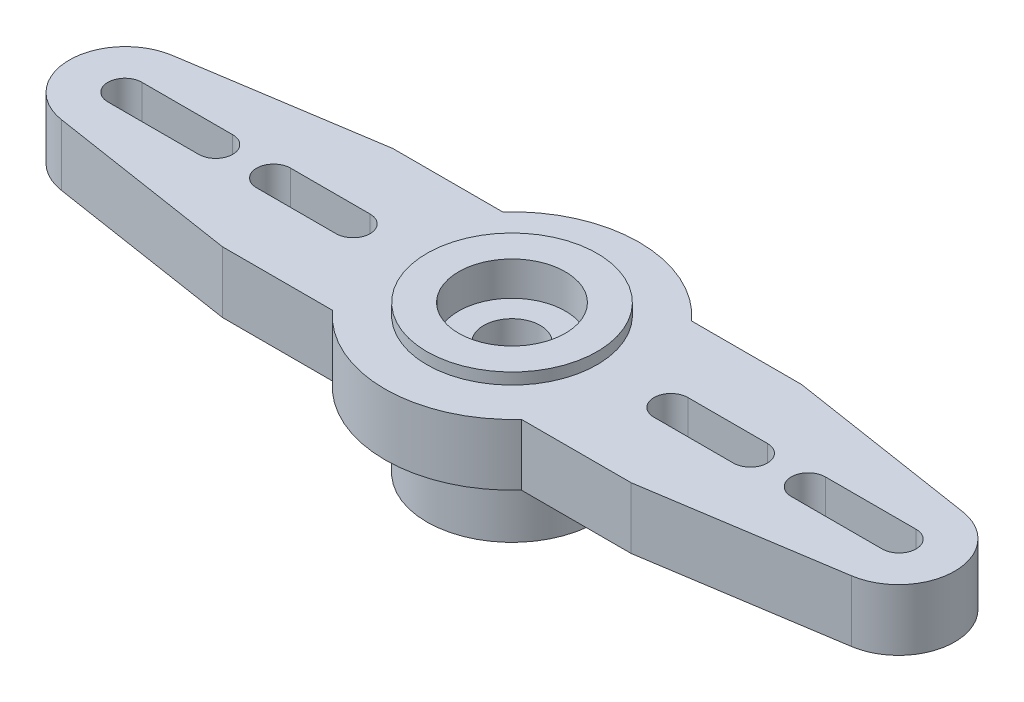
ISO-10303-21;
HEADER;
FILE_DESCRIPTION(('STEP AP214'),'2;1');
FILE_NAME('part.step','',(''),(''),'','','');
FILE_SCHEMA(('AUTOMOTIVE_DESIGN { 1 0 10303 214 1 1 1 1 }'));
ENDSEC;
DATA;
#1=APPLICATION_CONTEXT('core data for automotive mechanical design processes');
#2=APPLICATION_PROTOCOL_DEFINITION('international standard','automotive_design',2000,#1);
#3=PRODUCT_CONTEXT('',#1,'mechanical');
#4=PRODUCT('Part','Part','',(#3));
#5=PRODUCT_RELATED_PRODUCT_CATEGORY('part','',(#4));
#6=PRODUCT_DEFINITION_FORMATION('','',#4);
#7=PRODUCT_DEFINITION_CONTEXT('part definition',#1,'design');
#8=PRODUCT_DEFINITION('design','',#6,#7);
#9=PRODUCT_DEFINITION_SHAPE('','',#8);
#10=(LENGTH_UNIT() NAMED_UNIT(*) SI_UNIT(.MILLI.,.METRE.));
#11=(NAMED_UNIT(*) PLANE_ANGLE_UNIT() SI_UNIT($,.RADIAN.));
#12=(NAMED_UNIT(*) SI_UNIT($,.STERADIAN.) SOLID_ANGLE_UNIT());
#13=UNCERTAINTY_MEASURE_WITH_UNIT(LENGTH_MEASURE(1.E-05),#10,'distance_accuracy_value','');
#14=(GEOMETRIC_REPRESENTATION_CONTEXT(3) GLOBAL_UNCERTAINTY_ASSIGNED_CONTEXT((#13)) GLOBAL_UNIT_ASSIGNED_CONTEXT((#10,
#11,#12)) REPRESENTATION_CONTEXT('',''));
#15=CARTESIAN_POINT('',(0.,0.,0.));
#16=DIRECTION('',(0.,0.,1.));
#17=DIRECTION('',(1.,0.,0.));
#18=AXIS2_PLACEMENT_3D('',#15,#16,#17);
#19=CARTESIAN_POINT('',(0.,6.5,0.));
#20=DIRECTION('',(0.,-1.,0.));
#21=DIRECTION('',(0.,0.,-1.));
#22=AXIS2_PLACEMENT_3D('',#19,#20,#21);
#23=CYLINDRICAL_SURFACE('',#22,3.75);
#24=CARTESIAN_POINT('',(0.,0.,0.));
#25=DIRECTION('',(0.,1.,0.));
#26=DIRECTION('',(0.,0.,1.));
#27=AXIS2_PLACEMENT_3D('',#24,#25,#26);
#28=CIRCLE('',#27,3.75);
#29=CARTESIAN_POINT('',(0.,0.,3.75));
#30=VERTEX_POINT('',#29);
#31=EDGE_CURVE('E331',#30,#30,#28,.T.);
#32=ORIENTED_EDGE('',*,*,#31,.T.);
#33=EDGE_LOOP('',(#32));
#34=FACE_BOUND('',#33,.T.);
#35=CARTESIAN_POINT('',(0.,3.3,0.));
#36=DIRECTION('',(0.,1.,0.));
#37=DIRECTION('',(0.,0.,1.));
#38=AXIS2_PLACEMENT_3D('',#35,#36,#37);
#39=CIRCLE('',#38,3.75);
#40=CARTESIAN_POINT('',(0.,3.3,3.75));
#41=VERTEX_POINT('',#40);
#42=EDGE_CURVE('E12',#41,#41,#39,.T.);
#43=ORIENTED_EDGE('',*,*,#42,.F.);
#44=EDGE_LOOP('',(#43));
#45=FACE_BOUND('',#44,.T.);
#46=ADVANCED_FACE('F91',(#34,#45),#23,.T.);
#47=CARTESIAN_POINT('',(0.,0.,0.));
#48=DIRECTION('',(0.,1.,0.));
#49=DIRECTION('',(0.,0.,1.));
#50=AXIS2_PLACEMENT_3D('',#47,#48,#49);
#51=CYLINDRICAL_SURFACE('',#50,1.25);
#52=CARTESIAN_POINT('',(0.,5.,0.));
#53=DIRECTION('',(0.,1.,0.));
#54=DIRECTION('',(0.,0.,1.));
#55=AXIS2_PLACEMENT_3D('',#52,#53,#54);
#56=CIRCLE('',#55,1.25);
#57=CARTESIAN_POINT('',(0.,5.,1.25));
#58=VERTEX_POINT('',#57);
#59=EDGE_CURVE('E328',#58,#58,#56,.F.);
#60=ORIENTED_EDGE('',*,*,#59,.F.);
#61=EDGE_LOOP('',(#60));
#62=FACE_BOUND('',#61,.T.);
#63=CARTESIAN_POINT('',(0.,3.4,0.));
#64=DIRECTION('',(0.,-1.,0.));
#65=DIRECTION('',(0.,0.,-1.));
#66=AXIS2_PLACEMENT_3D('',#63,#64,#65);
#67=CIRCLE('',#66,1.25);
#68=CARTESIAN_POINT('',(0.,3.4,-1.25));
#69=VERTEX_POINT('',#68);
#70=EDGE_CURVE('E321',#69,#69,#67,.F.);
#71=ORIENTED_EDGE('',*,*,#70,.F.);
#72=EDGE_LOOP('',(#71));
#73=FACE_BOUND('',#72,.T.);
#74=ADVANCED_FACE('F343',(#62,#73),#51,.F.);
#75=CARTESIAN_POINT('',(0.,6.,0.));
#76=DIRECTION('',(0.,1.,0.));
#77=DIRECTION('',(0.,0.,1.));
#78=AXIS2_PLACEMENT_3D('',#75,#76,#77);
#79=CIRCLE('',#78,3.75);
#80=CARTESIAN_POINT('',(0.,6.,3.75));
#81=VERTEX_POINT('',#80);
#82=EDGE_CURVE('E306',#81,#81,#79,.T.);
#83=ORIENTED_EDGE('',*,*,#82,.T.);
#84=EDGE_LOOP('',(#83));
#85=FACE_BOUND('',#84,.T.);
#86=CARTESIAN_POINT('',(0.,6.5,0.));
#87=DIRECTION('',(0.,1.,0.));
#88=DIRECTION('',(0.,0.,1.));
#89=AXIS2_PLACEMENT_3D('',#86,#87,#88);
#90=CIRCLE('',#89,3.75);
#91=CARTESIAN_POINT('',(0.,6.5,3.75));
#92=VERTEX_POINT('',#91);
#93=EDGE_CURVE('E100',#92,#92,#90,.T.);
#94=ORIENTED_EDGE('',*,*,#93,.F.);
#95=EDGE_LOOP('',(#94));
#96=FACE_BOUND('',#95,.T.);
#97=ADVANCED_FACE('F93',(#85,#96),#23,.T.);
#98=CARTESIAN_POINT('',(0.,6.5,0.));
#99=DIRECTION('',(0.,1.,0.));
#100=DIRECTION('',(0.,0.,1.));
#101=AXIS2_PLACEMENT_3D('',#98,#99,#100);
#102=PLANE('',#101);
#103=CARTESIAN_POINT('',(0.,6.5,0.));
#104=DIRECTION('',(0.,1.,0.));
#105=DIRECTION('',(0.,0.,1.));
#106=AXIS2_PLACEMENT_3D('',#103,#104,#105);
#107=CIRCLE('',#106,2.35);
#108=CARTESIAN_POINT('',(0.,6.5,2.35));
#109=VERTEX_POINT('',#108);
#110=EDGE_CURVE('E334',#109,#109,#107,.F.);
#111=ORIENTED_EDGE('',*,*,#110,.T.);
#112=EDGE_LOOP('',(#111));
#113=FACE_BOUND('',#112,.T.);
#114=ORIENTED_EDGE('',*,*,#93,.T.);
#115=EDGE_LOOP('',(#114));
#116=FACE_BOUND('',#115,.T.);
#117=ADVANCED_FACE('F352',(#113,#116),#102,.T.);
#118=CARTESIAN_POINT('',(0.,0.,0.));
#119=DIRECTION('',(0.,1.,0.));
#120=DIRECTION('',(0.,0.,1.));
#121=AXIS2_PLACEMENT_3D('',#118,#119,#120);
#122=PLANE('',#121);
#123=CARTESIAN_POINT('',(0.,0.,0.));
#124=DIRECTION('',(0.,-1.,0.));
#125=DIRECTION('',(0.,0.,-1.));
#126=AXIS2_PLACEMENT_3D('',#123,#124,#125);
#127=CIRCLE('',#126,2.35);
#128=CARTESIAN_POINT('',(0.,0.,-2.35));
#129=VERTEX_POINT('',#128);
#130=EDGE_CURVE('E322',#129,#129,#127,.T.);
#131=ORIENTED_EDGE('',*,*,#130,.F.);
#132=EDGE_LOOP('',(#131));
#133=FACE_BOUND('',#132,.T.);
#134=ORIENTED_EDGE('',*,*,#31,.F.);
#135=EDGE_LOOP('',(#134));
#136=FACE_BOUND('',#135,.T.);
#137=ADVANCED_FACE('F362',(#133,#136),#122,.F.);
#138=CARTESIAN_POINT('',(0.,5.,0.));
#139=DIRECTION('',(0.,1.,0.));
#140=DIRECTION('',(0.,0.,1.));
#141=AXIS2_PLACEMENT_3D('',#138,#139,#140);
#142=PLANE('',#141);
#143=CARTESIAN_POINT('',(0.,5.,0.));
#144=DIRECTION('',(0.,1.,0.));
#145=DIRECTION('',(0.,0.,1.));
#146=AXIS2_PLACEMENT_3D('',#143,#144,#145);
#147=CIRCLE('',#146,2.35);
#148=CARTESIAN_POINT('',(0.,5.,2.35));
#149=VERTEX_POINT('',#148);
#150=EDGE_CURVE('E325',#149,#149,#147,.T.);
#151=ORIENTED_EDGE('',*,*,#150,.T.);
#152=EDGE_LOOP('',(#151));
#153=FACE_BOUND('',#152,.T.);
#154=ORIENTED_EDGE('',*,*,#59,.T.);
#155=EDGE_LOOP('',(#154));
#156=FACE_BOUND('',#155,.T.);
#157=ADVANCED_FACE('F364',(#153,#156),#142,.T.);
#158=CARTESIAN_POINT('',(0.,6.500012,0.));
#159=DIRECTION('',(0.,-1.,0.));
#160=DIRECTION('',(0.,0.,-1.));
#161=AXIS2_PLACEMENT_3D('',#158,#159,#160);
#162=CYLINDRICAL_SURFACE('',#161,2.35);
#163=ORIENTED_EDGE('',*,*,#110,.F.);
#164=EDGE_LOOP('',(#163));
#165=FACE_BOUND('',#164,.T.);
#166=ORIENTED_EDGE('',*,*,#150,.F.);
#167=EDGE_LOOP('',(#166));
#168=FACE_BOUND('',#167,.T.);
#169=ADVANCED_FACE('F359',(#165,#168),#162,.F.);
#170=CARTESIAN_POINT('',(0.,3.4,0.));
#171=DIRECTION('',(0.,-1.,0.));
#172=DIRECTION('',(0.,0.,-1.));
#173=AXIS2_PLACEMENT_3D('',#170,#171,#172);
#174=PLANE('',#173);
#175=CARTESIAN_POINT('',(0.,3.4,0.));
#176=DIRECTION('',(0.,-1.,0.));
#177=DIRECTION('',(0.,0.,-1.));
#178=AXIS2_PLACEMENT_3D('',#175,#176,#177);
#179=CIRCLE('',#178,2.35);
#180=CARTESIAN_POINT('',(0.,3.4,-2.35));
#181=VERTEX_POINT('',#180);
#182=EDGE_CURVE('E318',#181,#181,#179,.T.);
#183=ORIENTED_EDGE('',*,*,#182,.T.);
#184=EDGE_LOOP('',(#183));
#185=FACE_BOUND('',#184,.T.);
#186=ORIENTED_EDGE('',*,*,#70,.T.);
#187=EDGE_LOOP('',(#186));
#188=FACE_BOUND('',#187,.T.);
#189=ADVANCED_FACE('F341',(#185,#188),#174,.T.);
#190=CARTESIAN_POINT('',(0.,3.4,0.));
#191=DIRECTION('',(0.,-1.,0.));
#192=DIRECTION('',(0.,0.,-1.));
#193=AXIS2_PLACEMENT_3D('',#190,#191,#192);
#194=CYLINDRICAL_SURFACE('',#193,2.35);
#195=ORIENTED_EDGE('',*,*,#182,.F.);
#196=EDGE_LOOP('',(#195));
#197=FACE_BOUND('',#196,.T.);
#198=ORIENTED_EDGE('',*,*,#130,.T.);
#199=EDGE_LOOP('',(#198));
#200=FACE_BOUND('',#199,.T.);
#201=ADVANCED_FACE('F674',(#197,#200),#194,.F.);
#202=CARTESIAN_POINT('',(0.,3.3,0.75));
#203=DIRECTION('',(0.,0.,-1.));
#204=DIRECTION('',(-1.,0.,0.));
#205=AXIS2_PLACEMENT_3D('',#202,#203,#204);
#206=PLANE('',#205);
#207=DIRECTION('',(-1.,0.,0.));
#208=VECTOR('',#207,1.);
#209=CARTESIAN_POINT('',(0.,6.,0.75));
#210=LINE('',#209,#208);
#211=CARTESIAN_POINT('',(-7.,6.,0.75));
#212=VERTEX_POINT('',#211);
#213=CARTESIAN_POINT('',(-10.5,6.,0.75));
#214=VERTEX_POINT('',#213);
#215=EDGE_CURVE('E529',#212,#214,#210,.T.);
#216=ORIENTED_EDGE('',*,*,#215,.F.);
#217=DIRECTION('',(0.,1.,0.));
#218=VECTOR('',#217,1.);
#219=CARTESIAN_POINT('',(-7.,3.3,0.75));
#220=LINE('',#219,#218);
#221=CARTESIAN_POINT('',(-7.,3.3,0.75));
#222=VERTEX_POINT('',#221);
#223=EDGE_CURVE('E108',#222,#212,#220,.T.);
#224=ORIENTED_EDGE('',*,*,#223,.F.);
#225=DIRECTION('',(-1.,0.,0.));
#226=VECTOR('',#225,1.);
#227=CARTESIAN_POINT('',(0.,3.3,0.75));
#228=LINE('',#227,#226);
#229=CARTESIAN_POINT('',(-10.5,3.3,0.75));
#230=VERTEX_POINT('',#229);
#231=EDGE_CURVE('E565',#222,#230,#228,.T.);
#232=ORIENTED_EDGE('',*,*,#231,.T.);
#233=DIRECTION('',(0.,1.,0.));
#234=VECTOR('',#233,1.);
#235=CARTESIAN_POINT('',(-10.5,3.3,0.75));
#236=LINE('',#235,#234);
#237=EDGE_CURVE('E512',#230,#214,#236,.T.);
#238=ORIENTED_EDGE('',*,*,#237,.T.);
#239=EDGE_LOOP('',(#216,#224,#232,#238));
#240=FACE_BOUND('',#239,.T.);
#241=ADVANCED_FACE('F435',(#240),#206,.T.);
#242=CARTESIAN_POINT('',(-7.,3.3,0.));
#243=DIRECTION('',(0.,1.,0.));
#244=DIRECTION('',(0.,0.,1.));
#245=AXIS2_PLACEMENT_3D('',#242,#243,#244);
#246=CYLINDRICAL_SURFACE('',#245,0.75);
#247=CARTESIAN_POINT('',(-7.,6.,0.));
#248=DIRECTION('',(0.,1.,0.));
#249=DIRECTION('',(0.,0.,1.));
#250=AXIS2_PLACEMENT_3D('',#247,#248,#249);
#251=CIRCLE('',#250,0.75);
#252=CARTESIAN_POINT('',(-7.,6.,-0.75));
#253=VERTEX_POINT('',#252);
#254=EDGE_CURVE('E519',#253,#212,#251,.F.);
#255=ORIENTED_EDGE('',*,*,#254,.F.);
#256=DIRECTION('',(0.,1.,0.));
#257=VECTOR('',#256,1.);
#258=CARTESIAN_POINT('',(-7.,3.3,-0.75));
#259=LINE('',#258,#257);
#260=CARTESIAN_POINT('',(-7.,3.3,-0.75));
#261=VERTEX_POINT('',#260);
#262=EDGE_CURVE('E516',#261,#253,#259,.T.);
#263=ORIENTED_EDGE('',*,*,#262,.F.);
#264=CARTESIAN_POINT('',(-7.,3.3,0.));
#265=DIRECTION('',(0.,1.,0.));
#266=DIRECTION('',(0.,0.,1.));
#267=AXIS2_PLACEMENT_3D('',#264,#265,#266);
#268=CIRCLE('',#267,0.75);
#269=EDGE_CURVE('E494',#261,#222,#268,.F.);
#270=ORIENTED_EDGE('',*,*,#269,.T.);
#271=ORIENTED_EDGE('',*,*,#223,.T.);
#272=EDGE_LOOP('',(#255,#263,#270,#271));
#273=FACE_BOUND('',#272,.T.);
#274=ADVANCED_FACE('F650',(#273),#246,.F.);
#275=CARTESIAN_POINT('',(0.,3.3,-0.75));
#276=DIRECTION('',(0.,0.,-1.));
#277=DIRECTION('',(-1.,0.,0.));
#278=AXIS2_PLACEMENT_3D('',#275,#276,#277);
#279=PLANE('',#278);
#280=DIRECTION('',(-1.,0.,0.));
#281=VECTOR('',#280,1.);
#282=CARTESIAN_POINT('',(0.,6.,-0.75));
#283=LINE('',#282,#281);
#284=CARTESIAN_POINT('',(-10.5,6.,-0.75));
#285=VERTEX_POINT('',#284);
#286=EDGE_CURVE('E523',#253,#285,#283,.T.);
#287=ORIENTED_EDGE('',*,*,#286,.T.);
#288=DIRECTION('',(0.,1.,0.));
#289=VECTOR('',#288,1.);
#290=CARTESIAN_POINT('',(-10.5,3.3,-0.75));
#291=LINE('',#290,#289);
#292=CARTESIAN_POINT('',(-10.5,3.3,-0.75));
#293=VERTEX_POINT('',#292);
#294=EDGE_CURVE('E514',#293,#285,#291,.T.);
#295=ORIENTED_EDGE('',*,*,#294,.F.);
#296=DIRECTION('',(-1.,0.,0.));
#297=VECTOR('',#296,1.);
#298=CARTESIAN_POINT('',(0.,3.3,-0.75));
#299=LINE('',#298,#297);
#300=EDGE_CURVE('E559',#261,#293,#299,.T.);
#301=ORIENTED_EDGE('',*,*,#300,.F.);
#302=ORIENTED_EDGE('',*,*,#262,.T.);
#303=EDGE_LOOP('',(#287,#295,#301,#302));
#304=FACE_BOUND('',#303,.T.);
#305=ADVANCED_FACE('F644',(#304),#279,.F.);
#306=CARTESIAN_POINT('',(0.,3.3,0.749999999999998));
#307=DIRECTION('',(0.,0.,-1.));
#308=DIRECTION('',(-1.,0.,0.));
#309=AXIS2_PLACEMENT_3D('',#306,#307,#308);
#310=PLANE('',#309);
#311=DIRECTION('',(-1.,0.,0.));
#312=VECTOR('',#311,1.);
#313=CARTESIAN_POINT('',(0.,6.,0.749999999999998));
#314=LINE('',#313,#312);
#315=CARTESIAN_POINT('',(-13.05,6.,0.749999999999998));
#316=VERTEX_POINT('',#315);
#317=CARTESIAN_POINT('',(-17.05,6.,0.749999999999998));
#318=VERTEX_POINT('',#317);
#319=EDGE_CURVE('E541',#316,#318,#314,.T.);
#320=ORIENTED_EDGE('',*,*,#319,.F.);
#321=DIRECTION('',(0.,1.,0.));
#322=VECTOR('',#321,1.);
#323=CARTESIAN_POINT('',(-13.05,3.3,0.749999999999998));
#324=LINE('',#323,#322);
#325=CARTESIAN_POINT('',(-13.05,3.3,0.749999999999998));
#326=VERTEX_POINT('',#325);
#327=EDGE_CURVE('E510',#326,#316,#324,.T.);
#328=ORIENTED_EDGE('',*,*,#327,.F.);
#329=DIRECTION('',(-1.,0.,0.));
#330=VECTOR('',#329,1.);
#331=CARTESIAN_POINT('',(0.,3.3,0.749999999999998));
#332=LINE('',#331,#330);
#333=CARTESIAN_POINT('',(-17.05,3.3,0.749999999999998));
#334=VERTEX_POINT('',#333);
#335=EDGE_CURVE('E576',#326,#334,#332,.T.);
#336=ORIENTED_EDGE('',*,*,#335,.T.);
#337=DIRECTION('',(0.,1.,0.));
#338=VECTOR('',#337,1.);
#339=CARTESIAN_POINT('',(-17.05,3.3,0.749999999999998));
#340=LINE('',#339,#338);
#341=EDGE_CURVE('E504',#334,#318,#340,.T.);
#342=ORIENTED_EDGE('',*,*,#341,.T.);
#343=EDGE_LOOP('',(#320,#328,#336,#342));
#344=FACE_BOUND('',#343,.T.);
#345=ADVANCED_FACE('F668',(#344),#310,.T.);
#346=CARTESIAN_POINT('',(-13.05,3.3,0.));
#347=DIRECTION('',(0.,1.,0.));
#348=DIRECTION('',(0.,0.,1.));
#349=AXIS2_PLACEMENT_3D('',#346,#347,#348);
#350=CYLINDRICAL_SURFACE('',#349,0.749999999999998);
#351=CARTESIAN_POINT('',(-13.05,6.,0.));
#352=DIRECTION('',(0.,1.,0.));
#353=DIRECTION('',(0.,0.,1.));
#354=AXIS2_PLACEMENT_3D('',#351,#352,#353);
#355=CIRCLE('',#354,0.749999999999998);
#356=CARTESIAN_POINT('',(-13.05,6.,-0.749999999999998));
#357=VERTEX_POINT('',#356);
#358=EDGE_CURVE('E532',#357,#316,#355,.F.);
#359=ORIENTED_EDGE('',*,*,#358,.F.);
#360=DIRECTION('',(0.,1.,0.));
#361=VECTOR('',#360,1.);
#362=CARTESIAN_POINT('',(-13.05,3.3,-0.749999999999998));
#363=LINE('',#362,#361);
#364=CARTESIAN_POINT('',(-13.05,3.3,-0.749999999999998));
#365=VERTEX_POINT('',#364);
#366=EDGE_CURVE('E508',#365,#357,#363,.T.);
#367=ORIENTED_EDGE('',*,*,#366,.F.);
#368=CARTESIAN_POINT('',(-13.05,3.3,0.));
#369=DIRECTION('',(0.,1.,0.));
#370=DIRECTION('',(0.,0.,1.));
#371=AXIS2_PLACEMENT_3D('',#368,#369,#370);
#372=CIRCLE('',#371,0.749999999999998);
#373=EDGE_CURVE('E567',#365,#326,#372,.F.);
#374=ORIENTED_EDGE('',*,*,#373,.T.);
#375=ORIENTED_EDGE('',*,*,#327,.T.);
#376=EDGE_LOOP('',(#359,#367,#374,#375));
#377=FACE_BOUND('',#376,.T.);
#378=ADVANCED_FACE('F675',(#377),#350,.F.);
#379=CARTESIAN_POINT('',(0.,3.3,-0.749999999999998));
#380=DIRECTION('',(0.,0.,-1.));
#381=DIRECTION('',(-1.,0.,0.));
#382=AXIS2_PLACEMENT_3D('',#379,#380,#381);
#383=PLANE('',#382);
#384=DIRECTION('',(-1.,0.,0.));
#385=VECTOR('',#384,1.);
#386=CARTESIAN_POINT('',(0.,6.,-0.749999999999998));
#387=LINE('',#386,#385);
#388=CARTESIAN_POINT('',(-17.05,6.,-0.749999999999998));
#389=VERTEX_POINT('',#388);
#390=EDGE_CURVE('E535',#357,#389,#387,.T.);
#391=ORIENTED_EDGE('',*,*,#390,.T.);
#392=DIRECTION('',(0.,1.,0.));
#393=VECTOR('',#392,1.);
#394=CARTESIAN_POINT('',(-17.05,3.3,-0.749999999999998));
#395=LINE('',#394,#393);
#396=CARTESIAN_POINT('',(-17.05,3.3,-0.749999999999998));
#397=VERTEX_POINT('',#396);
#398=EDGE_CURVE('E506',#397,#389,#395,.T.);
#399=ORIENTED_EDGE('',*,*,#398,.F.);
#400=DIRECTION('',(-1.,0.,0.));
#401=VECTOR('',#400,1.);
#402=CARTESIAN_POINT('',(0.,3.3,-0.749999999999998));
#403=LINE('',#402,#401);
#404=EDGE_CURVE('E570',#365,#397,#403,.T.);
#405=ORIENTED_EDGE('',*,*,#404,.F.);
#406=ORIENTED_EDGE('',*,*,#366,.T.);
#407=EDGE_LOOP('',(#391,#399,#405,#406));
#408=FACE_BOUND('',#407,.T.);
#409=ADVANCED_FACE('F678',(#408),#383,.F.);
#410=CARTESIAN_POINT('',(-17.025,3.3,0.));
#411=DIRECTION('',(0.,1.,0.));
#412=DIRECTION('',(0.,0.,1.));
#413=AXIS2_PLACEMENT_3D('',#410,#411,#412);
#414=CYLINDRICAL_SURFACE('',#413,2.475);
#415=CARTESIAN_POINT('',(-17.025,6.,0.));
#416=DIRECTION('',(0.,1.,0.));
#417=DIRECTION('',(0.,0.,1.));
#418=AXIS2_PLACEMENT_3D('',#415,#416,#417);
#419=CIRCLE('',#418,2.475);
#420=CARTESIAN_POINT('',(-17.4045444173282,6.,2.44572505308241));
#421=VERTEX_POINT('',#420);
#422=CARTESIAN_POINT('',(-17.4045444173282,6.,-2.44572505308241));
#423=VERTEX_POINT('',#422);
#424=EDGE_CURVE('E254',#421,#423,#419,.F.);
#425=ORIENTED_EDGE('',*,*,#424,.T.);
#426=DIRECTION('',(0.,1.,0.));
#427=VECTOR('',#426,1.);
#428=CARTESIAN_POINT('',(-17.4045444173282,3.3,-2.44572505308241));
#429=LINE('',#428,#427);
#430=CARTESIAN_POINT('',(-17.4045444173282,3.3,-2.44572505308241));
#431=VERTEX_POINT('',#430);
#432=EDGE_CURVE('E502',#431,#423,#429,.T.);
#433=ORIENTED_EDGE('',*,*,#432,.F.);
#434=CARTESIAN_POINT('',(-17.025,3.3,0.));
#435=DIRECTION('',(0.,1.,0.));
#436=DIRECTION('',(0.,0.,1.));
#437=AXIS2_PLACEMENT_3D('',#434,#435,#436);
#438=CIRCLE('',#437,2.475);
#439=CARTESIAN_POINT('',(-17.4045444173282,3.3,2.44572505308241));
#440=VERTEX_POINT('',#439);
#441=EDGE_CURVE('E522',#440,#431,#438,.F.);
#442=ORIENTED_EDGE('',*,*,#441,.F.);
#443=DIRECTION('',(0.,1.,0.));
#444=VECTOR('',#443,1.);
#445=CARTESIAN_POINT('',(-17.4045444173282,3.3,2.44572505308241));
#446=LINE('',#445,#444);
#447=EDGE_CURVE('E490',#440,#421,#446,.T.);
#448=ORIENTED_EDGE('',*,*,#447,.T.);
#449=EDGE_LOOP('',(#425,#433,#442,#448));
#450=FACE_BOUND('',#449,.T.);
#451=ADVANCED_FACE('F604',(#450),#414,.T.);
#452=CARTESIAN_POINT('',(-0.779914787607765,3.3,-5.02564930015078));
#453=DIRECTION('',(-0.153351279728578,0.,-0.988171738619157));
#454=DIRECTION('',(-0.988171738619157,0.,0.153351279728578));
#455=AXIS2_PLACEMENT_3D('',#452,#453,#454);
#456=PLANE('',#455);
#457=DIRECTION('',(-0.988171738619157,0.,0.153351279728578));
#458=VECTOR('',#457,1.);
#459=CARTESIAN_POINT('',(-0.779914787607765,6.,-5.02564930015078));
#460=LINE('',#459,#458);
#461=CARTESIAN_POINT('',(-9.,6.,-3.75));
#462=VERTEX_POINT('',#461);
#463=EDGE_CURVE('E544',#462,#423,#460,.T.);
#464=ORIENTED_EDGE('',*,*,#463,.F.);
#465=DIRECTION('',(0.,1.,0.));
#466=VECTOR('',#465,1.);
#467=CARTESIAN_POINT('',(-9.,3.3,-3.75));
#468=LINE('',#467,#466);
#469=CARTESIAN_POINT('',(-9.,3.3,-3.75));
#470=VERTEX_POINT('',#469);
#471=EDGE_CURVE('E500',#470,#462,#468,.T.);
#472=ORIENTED_EDGE('',*,*,#471,.F.);
#473=DIRECTION('',(-0.988171738619157,0.,0.153351279728578));
#474=VECTOR('',#473,1.);
#475=CARTESIAN_POINT('',(-0.779914787607765,3.3,-5.02564930015078));
#476=LINE('',#475,#474);
#477=EDGE_CURVE('E579',#470,#431,#476,.T.);
#478=ORIENTED_EDGE('',*,*,#477,.T.);
#479=ORIENTED_EDGE('',*,*,#432,.T.);
#480=EDGE_LOOP('',(#464,#472,#478,#479));
#481=FACE_BOUND('',#480,.T.);
#482=ADVANCED_FACE('F609',(#481),#456,.T.);
#483=CARTESIAN_POINT('',(0.,3.3,-3.75));
#484=DIRECTION('',(0.,0.,1.));
#485=DIRECTION('',(1.,0.,0.));
#486=AXIS2_PLACEMENT_3D('',#483,#484,#485);
#487=PLANE('',#486);
#488=DIRECTION('',(1.,0.,0.));
#489=VECTOR('',#488,1.);
#490=CARTESIAN_POINT('',(0.,6.,-3.75));
#491=LINE('',#490,#489);
#492=CARTESIAN_POINT('',(-4.159026328361,6.,-3.75));
#493=VERTEX_POINT('',#492);
#494=EDGE_CURVE('E547',#462,#493,#491,.T.);
#495=ORIENTED_EDGE('',*,*,#494,.T.);
#496=DIRECTION('',(0.,1.,0.));
#497=VECTOR('',#496,1.);
#498=CARTESIAN_POINT('',(-4.159026328361,3.3,-3.75));
#499=LINE('',#498,#497);
#500=CARTESIAN_POINT('',(-4.159026328361,3.3,-3.75));
#501=VERTEX_POINT('',#500);
#502=EDGE_CURVE('E498',#501,#493,#499,.T.);
#503=ORIENTED_EDGE('',*,*,#502,.F.);
#504=DIRECTION('',(1.,0.,0.));
#505=VECTOR('',#504,1.);
#506=CARTESIAN_POINT('',(0.,3.3,-3.75));
#507=LINE('',#506,#505);
#508=EDGE_CURVE('E582',#470,#501,#507,.T.);
#509=ORIENTED_EDGE('',*,*,#508,.F.);
#510=ORIENTED_EDGE('',*,*,#471,.T.);
#511=EDGE_LOOP('',(#495,#503,#509,#510));
#512=FACE_BOUND('',#511,.T.);
#513=ADVANCED_FACE('F616',(#512),#487,.F.);
#514=CARTESIAN_POINT('',(0.,3.3,3.75));
#515=DIRECTION('',(0.,0.,1.));
#516=DIRECTION('',(1.,0.,0.));
#517=AXIS2_PLACEMENT_3D('',#514,#515,#516);
#518=PLANE('',#517);
#519=DIRECTION('',(1.,0.,0.));
#520=VECTOR('',#519,1.);
#521=CARTESIAN_POINT('',(0.,6.,3.75));
#522=LINE('',#521,#520);
#523=CARTESIAN_POINT('',(-9.,6.,3.75));
#524=VERTEX_POINT('',#523);
#525=CARTESIAN_POINT('',(-4.159026328361,6.,3.75));
#526=VERTEX_POINT('',#525);
#527=EDGE_CURVE('E550',#524,#526,#522,.T.);
#528=ORIENTED_EDGE('',*,*,#527,.F.);
#529=DIRECTION('',(0.,1.,0.));
#530=VECTOR('',#529,1.);
#531=CARTESIAN_POINT('',(-9.,3.3,3.75));
#532=LINE('',#531,#530);
#533=CARTESIAN_POINT('',(-9.,3.3,3.75));
#534=VERTEX_POINT('',#533);
#535=EDGE_CURVE('E493',#534,#524,#532,.T.);
#536=ORIENTED_EDGE('',*,*,#535,.F.);
#537=DIRECTION('',(1.,0.,0.));
#538=VECTOR('',#537,1.);
#539=CARTESIAN_POINT('',(0.,3.3,3.75));
#540=LINE('',#539,#538);
#541=CARTESIAN_POINT('',(-4.159026328361,3.3,3.75));
#542=VERTEX_POINT('',#541);
#543=EDGE_CURVE('E585',#534,#542,#540,.T.);
#544=ORIENTED_EDGE('',*,*,#543,.T.);
#545=DIRECTION('',(0.,1.,0.));
#546=VECTOR('',#545,1.);
#547=CARTESIAN_POINT('',(-4.159026328361,3.3,3.75));
#548=LINE('',#547,#546);
#549=EDGE_CURVE('E496',#542,#526,#548,.T.);
#550=ORIENTED_EDGE('',*,*,#549,.T.);
#551=EDGE_LOOP('',(#528,#536,#544,#550));
#552=FACE_BOUND('',#551,.T.);
#553=ADVANCED_FACE('F686',(#552),#518,.T.);
#554=CARTESIAN_POINT('',(-17.05,3.3,0.));
#555=DIRECTION('',(0.,1.,0.));
#556=DIRECTION('',(0.,0.,1.));
#557=AXIS2_PLACEMENT_3D('',#554,#555,#556);
#558=CYLINDRICAL_SURFACE('',#557,0.749999999999998);
#559=CARTESIAN_POINT('',(-17.05,6.,0.));
#560=DIRECTION('',(0.,1.,0.));
#561=DIRECTION('',(0.,0.,1.));
#562=AXIS2_PLACEMENT_3D('',#559,#560,#561);
#563=CIRCLE('',#562,0.749999999999998);
#564=EDGE_CURVE('E538',#318,#389,#563,.F.);
#565=ORIENTED_EDGE('',*,*,#564,.F.);
#566=ORIENTED_EDGE('',*,*,#341,.F.);
#567=CARTESIAN_POINT('',(-17.05,3.3,0.));
#568=DIRECTION('',(0.,1.,0.));
#569=DIRECTION('',(0.,0.,1.));
#570=AXIS2_PLACEMENT_3D('',#567,#568,#569);
#571=CIRCLE('',#570,0.749999999999998);
#572=EDGE_CURVE('E573',#334,#397,#571,.F.);
#573=ORIENTED_EDGE('',*,*,#572,.T.);
#574=ORIENTED_EDGE('',*,*,#398,.T.);
#575=EDGE_LOOP('',(#565,#566,#573,#574));
#576=FACE_BOUND('',#575,.T.);
#577=ADVANCED_FACE('F683',(#576),#558,.F.);
#578=CARTESIAN_POINT('',(-0.779914787607765,3.3,5.02564930015078));
#579=DIRECTION('',(0.153351279728578,0.,-0.988171738619157));
#580=DIRECTION('',(-0.988171738619157,0.,-0.153351279728578));
#581=AXIS2_PLACEMENT_3D('',#578,#579,#580);
#582=PLANE('',#581);
#583=DIRECTION('',(-0.988171738619157,0.,-0.153351279728578));
#584=VECTOR('',#583,1.);
#585=CARTESIAN_POINT('',(-0.779914787607765,6.,5.02564930015078));
#586=LINE('',#585,#584);
#587=EDGE_CURVE('E553',#524,#421,#586,.T.);
#588=ORIENTED_EDGE('',*,*,#587,.T.);
#589=ORIENTED_EDGE('',*,*,#447,.F.);
#590=DIRECTION('',(-0.988171738619157,0.,-0.153351279728578));
#591=VECTOR('',#590,1.);
#592=CARTESIAN_POINT('',(-0.779914787607765,3.3,5.02564930015078));
#593=LINE('',#592,#591);
#594=EDGE_CURVE('E588',#534,#440,#593,.T.);
#595=ORIENTED_EDGE('',*,*,#594,.F.);
#596=ORIENTED_EDGE('',*,*,#535,.T.);
#597=EDGE_LOOP('',(#588,#589,#595,#596));
#598=FACE_BOUND('',#597,.T.);
#599=ADVANCED_FACE('F671',(#598),#582,.F.);
#600=CARTESIAN_POINT('',(-10.5,3.3,0.));
#601=DIRECTION('',(0.,1.,0.));
#602=DIRECTION('',(0.,0.,1.));
#603=AXIS2_PLACEMENT_3D('',#600,#601,#602);
#604=CYLINDRICAL_SURFACE('',#603,0.75);
#605=CARTESIAN_POINT('',(-10.5,6.,0.));
#606=DIRECTION('',(0.,1.,0.));
#607=DIRECTION('',(0.,0.,1.));
#608=AXIS2_PLACEMENT_3D('',#605,#606,#607);
#609=CIRCLE('',#608,0.75);
#610=EDGE_CURVE('E526',#214,#285,#609,.F.);
#611=ORIENTED_EDGE('',*,*,#610,.F.);
#612=ORIENTED_EDGE('',*,*,#237,.F.);
#613=CARTESIAN_POINT('',(-10.5,3.3,0.));
#614=DIRECTION('',(0.,1.,0.));
#615=DIRECTION('',(0.,0.,1.));
#616=AXIS2_PLACEMENT_3D('',#613,#614,#615);
#617=CIRCLE('',#616,0.75);
#618=EDGE_CURVE('E562',#230,#293,#617,.F.);
#619=ORIENTED_EDGE('',*,*,#618,.T.);
#620=ORIENTED_EDGE('',*,*,#294,.T.);
#621=EDGE_LOOP('',(#611,#612,#619,#620));
#622=FACE_BOUND('',#621,.T.);
#623=ADVANCED_FACE('F380',(#622),#604,.F.);
#624=CARTESIAN_POINT('',(0.,3.3,0.));
#625=DIRECTION('',(0.,1.,0.));
#626=DIRECTION('',(0.,0.,1.));
#627=AXIS2_PLACEMENT_3D('',#624,#625,#626);
#628=PLANE('',#627);
#629=ORIENTED_EDGE('',*,*,#441,.T.);
#630=ORIENTED_EDGE('',*,*,#477,.F.);
#631=ORIENTED_EDGE('',*,*,#508,.T.);
#632=CARTESIAN_POINT('',(0.,3.3,0.));
#633=DIRECTION('',(0.,1.,0.));
#634=DIRECTION('',(0.,0.,1.));
#635=AXIS2_PLACEMENT_3D('',#632,#633,#634);
#636=CIRCLE('',#635,5.6);
#637=CARTESIAN_POINT('',(4.159026328361,3.3,-3.75));
#638=VERTEX_POINT('',#637);
#639=EDGE_CURVE('E310',#638,#501,#636,.T.);
#640=ORIENTED_EDGE('',*,*,#639,.F.);
#641=DIRECTION('',(1.,0.,0.));
#642=VECTOR('',#641,1.);
#643=CARTESIAN_POINT('',(0.,3.3,-3.75));
#644=LINE('',#643,#642);
#645=CARTESIAN_POINT('',(9.,3.3,-3.75));
#646=VERTEX_POINT('',#645);
#647=EDGE_CURVE('E479',#638,#646,#644,.T.);
#648=ORIENTED_EDGE('',*,*,#647,.T.);
#649=DIRECTION('',(0.988171738619157,0.,0.153351279728578));
#650=VECTOR('',#649,1.);
#651=CARTESIAN_POINT('',(0.779914787607765,3.3,-5.02564930015078));
#652=LINE('',#651,#650);
#653=CARTESIAN_POINT('',(17.4045444173282,3.3,-2.44572505308241));
#654=VERTEX_POINT('',#653);
#655=EDGE_CURVE('E483',#646,#654,#652,.T.);
#656=ORIENTED_EDGE('',*,*,#655,.T.);
#657=CARTESIAN_POINT('',(17.025,3.3,0.));
#658=DIRECTION('',(0.,1.,0.));
#659=DIRECTION('',(0.,0.,1.));
#660=AXIS2_PLACEMENT_3D('',#657,#658,#659);
#661=CIRCLE('',#660,2.475);
#662=CARTESIAN_POINT('',(17.4045444173282,3.3,2.44572505308241));
#663=VERTEX_POINT('',#662);
#664=EDGE_CURVE('E485',#663,#654,#661,.T.);
#665=ORIENTED_EDGE('',*,*,#664,.F.);
#666=DIRECTION('',(0.988171738619157,0.,-0.153351279728578));
#667=VECTOR('',#666,1.);
#668=CARTESIAN_POINT('',(0.779914787607765,3.3,5.02564930015078));
#669=LINE('',#668,#667);
#670=CARTESIAN_POINT('',(9.,3.3,3.75));
#671=VERTEX_POINT('',#670);
#672=EDGE_CURVE('E272',#671,#663,#669,.T.);
#673=ORIENTED_EDGE('',*,*,#672,.F.);
#674=DIRECTION('',(1.,0.,0.));
#675=VECTOR('',#674,1.);
#676=CARTESIAN_POINT('',(0.,3.3,3.75));
#677=LINE('',#676,#675);
#678=CARTESIAN_POINT('',(4.159026328361,3.3,3.75));
#679=VERTEX_POINT('',#678);
#680=EDGE_CURVE('E269',#679,#671,#677,.T.);
#681=ORIENTED_EDGE('',*,*,#680,.F.);
#682=EDGE_CURVE('E314',#542,#679,#636,.T.);
#683=ORIENTED_EDGE('',*,*,#682,.F.);
#684=ORIENTED_EDGE('',*,*,#543,.F.);
#685=ORIENTED_EDGE('',*,*,#594,.T.);
#686=EDGE_LOOP('',(#629,#630,#631,#640,#648,#656,#665,#673,#681,#683,#684,#685));
#687=FACE_BOUND('',#686,.T.);
#688=ORIENTED_EDGE('',*,*,#335,.F.);
#689=ORIENTED_EDGE('',*,*,#373,.F.);
#690=ORIENTED_EDGE('',*,*,#404,.T.);
#691=ORIENTED_EDGE('',*,*,#572,.F.);
#692=EDGE_LOOP('',(#688,#689,#690,#691));
#693=FACE_BOUND('',#692,.T.);
#694=ORIENTED_EDGE('',*,*,#231,.F.);
#695=ORIENTED_EDGE('',*,*,#269,.F.);
#696=ORIENTED_EDGE('',*,*,#300,.T.);
#697=ORIENTED_EDGE('',*,*,#618,.F.);
#698=EDGE_LOOP('',(#694,#695,#696,#697));
#699=FACE_BOUND('',#698,.T.);
#700=ORIENTED_EDGE('',*,*,#42,.T.);
#701=EDGE_LOOP('',(#700));
#702=FACE_BOUND('',#701,.T.);
#703=CARTESIAN_POINT('',(10.5,3.3,0.));
#704=DIRECTION('',(0.,1.,0.));
#705=DIRECTION('',(0.,0.,1.));
#706=AXIS2_PLACEMENT_3D('',#703,#704,#705);
#707=CIRCLE('',#706,0.75);
#708=CARTESIAN_POINT('',(10.5,3.3,0.75));
#709=VERTEX_POINT('',#708);
#710=CARTESIAN_POINT('',(10.5,3.3,-0.75));
#711=VERTEX_POINT('',#710);
#712=EDGE_CURVE('E386',#709,#711,#707,.T.);
#713=ORIENTED_EDGE('',*,*,#712,.T.);
#714=DIRECTION('',(1.,0.,0.));
#715=VECTOR('',#714,1.);
#716=CARTESIAN_POINT('',(0.,3.3,-0.75));
#717=LINE('',#716,#715);
#718=CARTESIAN_POINT('',(7.,3.3,-0.75));
#719=VERTEX_POINT('',#718);
#720=EDGE_CURVE('E391',#719,#711,#717,.T.);
#721=ORIENTED_EDGE('',*,*,#720,.F.);
#722=CARTESIAN_POINT('',(7.,3.3,0.));
#723=DIRECTION('',(0.,1.,0.));
#724=DIRECTION('',(0.,0.,1.));
#725=AXIS2_PLACEMENT_3D('',#722,#723,#724);
#726=CIRCLE('',#725,0.75);
#727=CARTESIAN_POINT('',(7.,3.3,0.75));
#728=VERTEX_POINT('',#727);
#729=EDGE_CURVE('E396',#719,#728,#726,.T.);
#730=ORIENTED_EDGE('',*,*,#729,.T.);
#731=DIRECTION('',(1.,0.,0.));
#732=VECTOR('',#731,1.);
#733=CARTESIAN_POINT('',(0.,3.3,0.75));
#734=LINE('',#733,#732);
#735=EDGE_CURVE('E477',#728,#709,#734,.T.);
#736=ORIENTED_EDGE('',*,*,#735,.T.);
#737=EDGE_LOOP('',(#713,#721,#730,#736));
#738=FACE_BOUND('',#737,.T.);
#739=CARTESIAN_POINT('',(17.05,3.3,0.));
#740=DIRECTION('',(0.,1.,0.));
#741=DIRECTION('',(0.,0.,1.));
#742=AXIS2_PLACEMENT_3D('',#739,#740,#741);
#743=CIRCLE('',#742,0.749999999999998);
#744=CARTESIAN_POINT('',(17.05,3.3,0.749999999999998));
#745=VERTEX_POINT('',#744);
#746=CARTESIAN_POINT('',(17.05,3.3,-0.749999999999998));
#747=VERTEX_POINT('',#746);
#748=EDGE_CURVE('E388',#745,#747,#743,.T.);
#749=ORIENTED_EDGE('',*,*,#748,.T.);
#750=DIRECTION('',(1.,0.,0.));
#751=VECTOR('',#750,1.);
#752=CARTESIAN_POINT('',(0.,3.3,-0.749999999999998));
#753=LINE('',#752,#751);
#754=CARTESIAN_POINT('',(13.05,3.3,-0.749999999999998));
#755=VERTEX_POINT('',#754);
#756=EDGE_CURVE('E251',#755,#747,#753,.T.);
#757=ORIENTED_EDGE('',*,*,#756,.F.);
#758=CARTESIAN_POINT('',(13.05,3.3,0.));
#759=DIRECTION('',(0.,1.,0.));
#760=DIRECTION('',(0.,0.,1.));
#761=AXIS2_PLACEMENT_3D('',#758,#759,#760);
#762=CIRCLE('',#761,0.749999999999998);
#763=CARTESIAN_POINT('',(13.05,3.3,0.749999999999998));
#764=VERTEX_POINT('',#763);
#765=EDGE_CURVE('E393',#755,#764,#762,.T.);
#766=ORIENTED_EDGE('',*,*,#765,.T.);
#767=DIRECTION('',(1.,0.,0.));
#768=VECTOR('',#767,1.);
#769=CARTESIAN_POINT('',(0.,3.3,0.749999999999998));
#770=LINE('',#769,#768);
#771=EDGE_CURVE('E390',#764,#745,#770,.T.);
#772=ORIENTED_EDGE('',*,*,#771,.T.);
#773=EDGE_LOOP('',(#749,#757,#766,#772));
#774=FACE_BOUND('',#773,.T.);
#775=ADVANCED_FACE('F377',(#687,#693,#699,#702,#738,#774),#628,.F.);
#776=CARTESIAN_POINT('',(0.,6.,0.));
#777=DIRECTION('',(0.,1.,0.));
#778=DIRECTION('',(0.,0.,1.));
#779=AXIS2_PLACEMENT_3D('',#776,#777,#778);
#780=PLANE('',#779);
#781=ORIENTED_EDGE('',*,*,#424,.F.);
#782=ORIENTED_EDGE('',*,*,#587,.F.);
#783=ORIENTED_EDGE('',*,*,#527,.T.);
#784=CARTESIAN_POINT('',(0.,6.,0.));
#785=DIRECTION('',(0.,1.,0.));
#786=DIRECTION('',(0.,0.,1.));
#787=AXIS2_PLACEMENT_3D('',#784,#785,#786);
#788=CIRCLE('',#787,5.6);
#789=CARTESIAN_POINT('',(4.159026328361,6.,3.75));
#790=VERTEX_POINT('',#789);
#791=EDGE_CURVE('E309',#526,#790,#788,.T.);
#792=ORIENTED_EDGE('',*,*,#791,.T.);
#793=DIRECTION('',(1.,0.,0.));
#794=VECTOR('',#793,1.);
#795=CARTESIAN_POINT('',(0.,6.,3.75));
#796=LINE('',#795,#794);
#797=CARTESIAN_POINT('',(9.,6.,3.75));
#798=VERTEX_POINT('',#797);
#799=EDGE_CURVE('E313',#790,#798,#796,.T.);
#800=ORIENTED_EDGE('',*,*,#799,.T.);
#801=DIRECTION('',(0.988171738619157,0.,-0.153351279728578));
#802=VECTOR('',#801,1.);
#803=CARTESIAN_POINT('',(0.779914787607765,6.,5.02564930015078));
#804=LINE('',#803,#802);
#805=CARTESIAN_POINT('',(17.4045444173282,6.,2.44572505308241));
#806=VERTEX_POINT('',#805);
#807=EDGE_CURVE('E404',#798,#806,#804,.T.);
#808=ORIENTED_EDGE('',*,*,#807,.T.);
#809=CARTESIAN_POINT('',(17.025,6.,0.));
#810=DIRECTION('',(0.,1.,0.));
#811=DIRECTION('',(0.,0.,1.));
#812=AXIS2_PLACEMENT_3D('',#809,#810,#811);
#813=CIRCLE('',#812,2.475);
#814=CARTESIAN_POINT('',(17.4045444173282,6.,-2.44572505308241));
#815=VERTEX_POINT('',#814);
#816=EDGE_CURVE('E407',#806,#815,#813,.T.);
#817=ORIENTED_EDGE('',*,*,#816,.T.);
#818=DIRECTION('',(0.988171738619157,0.,0.153351279728578));
#819=VECTOR('',#818,1.);
#820=CARTESIAN_POINT('',(0.779914787607765,6.,-5.02564930015078));
#821=LINE('',#820,#819);
#822=CARTESIAN_POINT('',(9.,6.,-3.75));
#823=VERTEX_POINT('',#822);
#824=EDGE_CURVE('E410',#823,#815,#821,.T.);
#825=ORIENTED_EDGE('',*,*,#824,.F.);
#826=DIRECTION('',(1.,0.,0.));
#827=VECTOR('',#826,1.);
#828=CARTESIAN_POINT('',(0.,6.,-3.75));
#829=LINE('',#828,#827);
#830=CARTESIAN_POINT('',(4.159026328361,6.,-3.75));
#831=VERTEX_POINT('',#830);
#832=EDGE_CURVE('E413',#831,#823,#829,.T.);
#833=ORIENTED_EDGE('',*,*,#832,.F.);
#834=EDGE_CURVE('E315',#831,#493,#788,.T.);
#835=ORIENTED_EDGE('',*,*,#834,.T.);
#836=ORIENTED_EDGE('',*,*,#494,.F.);
#837=ORIENTED_EDGE('',*,*,#463,.T.);
#838=EDGE_LOOP('',(#781,#782,#783,#792,#800,#808,#817,#825,#833,#835,#836,#837));
#839=FACE_BOUND('',#838,.T.);
#840=ORIENTED_EDGE('',*,*,#319,.T.);
#841=ORIENTED_EDGE('',*,*,#564,.T.);
#842=ORIENTED_EDGE('',*,*,#390,.F.);
#843=ORIENTED_EDGE('',*,*,#358,.T.);
#844=EDGE_LOOP('',(#840,#841,#842,#843));
#845=FACE_BOUND('',#844,.T.);
#846=ORIENTED_EDGE('',*,*,#215,.T.);
#847=ORIENTED_EDGE('',*,*,#610,.T.);
#848=ORIENTED_EDGE('',*,*,#286,.F.);
#849=ORIENTED_EDGE('',*,*,#254,.T.);
#850=EDGE_LOOP('',(#846,#847,#848,#849));
#851=FACE_BOUND('',#850,.T.);
#852=ORIENTED_EDGE('',*,*,#82,.F.);
#853=EDGE_LOOP('',(#852));
#854=FACE_BOUND('',#853,.T.);
#855=CARTESIAN_POINT('',(10.5,6.,0.));
#856=DIRECTION('',(0.,1.,0.));
#857=DIRECTION('',(0.,0.,1.));
#858=AXIS2_PLACEMENT_3D('',#855,#856,#857);
#859=CIRCLE('',#858,0.75);
#860=CARTESIAN_POINT('',(10.5,6.,0.75));
#861=VERTEX_POINT('',#860);
#862=CARTESIAN_POINT('',(10.5,6.,-0.75));
#863=VERTEX_POINT('',#862);
#864=EDGE_CURVE('E415',#861,#863,#859,.T.);
#865=ORIENTED_EDGE('',*,*,#864,.F.);
#866=DIRECTION('',(1.,0.,0.));
#867=VECTOR('',#866,1.);
#868=CARTESIAN_POINT('',(0.,6.,0.75));
#869=LINE('',#868,#867);
#870=CARTESIAN_POINT('',(7.,6.,0.75));
#871=VERTEX_POINT('',#870);
#872=EDGE_CURVE('E418',#871,#861,#869,.T.);
#873=ORIENTED_EDGE('',*,*,#872,.F.);
#874=CARTESIAN_POINT('',(7.,6.,0.));
#875=DIRECTION('',(0.,1.,0.));
#876=DIRECTION('',(0.,0.,1.));
#877=AXIS2_PLACEMENT_3D('',#874,#875,#876);
#878=CIRCLE('',#877,0.75);
#879=CARTESIAN_POINT('',(7.,6.,-0.75));
#880=VERTEX_POINT('',#879);
#881=EDGE_CURVE('E420',#880,#871,#878,.T.);
#882=ORIENTED_EDGE('',*,*,#881,.F.);
#883=DIRECTION('',(1.,0.,0.));
#884=VECTOR('',#883,1.);
#885=CARTESIAN_POINT('',(0.,6.,-0.75));
#886=LINE('',#885,#884);
#887=EDGE_CURVE('E265',#880,#863,#886,.T.);
#888=ORIENTED_EDGE('',*,*,#887,.T.);
#889=EDGE_LOOP('',(#865,#873,#882,#888));
#890=FACE_BOUND('',#889,.T.);
#891=CARTESIAN_POINT('',(17.05,6.,0.));
#892=DIRECTION('',(0.,1.,0.));
#893=DIRECTION('',(0.,0.,1.));
#894=AXIS2_PLACEMENT_3D('',#891,#892,#893);
#895=CIRCLE('',#894,0.749999999999998);
#896=CARTESIAN_POINT('',(17.05,6.,0.749999999999998));
#897=VERTEX_POINT('',#896);
#898=CARTESIAN_POINT('',(17.05,6.,-0.749999999999998));
#899=VERTEX_POINT('',#898);
#900=EDGE_CURVE('E258',#897,#899,#895,.T.);
#901=ORIENTED_EDGE('',*,*,#900,.F.);
#902=DIRECTION('',(1.,0.,0.));
#903=VECTOR('',#902,1.);
#904=CARTESIAN_POINT('',(0.,6.,0.749999999999998));
#905=LINE('',#904,#903);
#906=CARTESIAN_POINT('',(13.05,6.,0.749999999999998));
#907=VERTEX_POINT('',#906);
#908=EDGE_CURVE('E264',#907,#897,#905,.T.);
#909=ORIENTED_EDGE('',*,*,#908,.F.);
#910=CARTESIAN_POINT('',(13.05,6.,0.));
#911=DIRECTION('',(0.,1.,0.));
#912=DIRECTION('',(0.,0.,1.));
#913=AXIS2_PLACEMENT_3D('',#910,#911,#912);
#914=CIRCLE('',#913,0.749999999999998);
#915=CARTESIAN_POINT('',(13.05,6.,-0.749999999999998));
#916=VERTEX_POINT('',#915);
#917=EDGE_CURVE('E268',#916,#907,#914,.T.);
#918=ORIENTED_EDGE('',*,*,#917,.F.);
#919=DIRECTION('',(1.,0.,0.));
#920=VECTOR('',#919,1.);
#921=CARTESIAN_POINT('',(0.,6.,-0.749999999999998));
#922=LINE('',#921,#920);
#923=EDGE_CURVE('E249',#916,#899,#922,.T.);
#924=ORIENTED_EDGE('',*,*,#923,.T.);
#925=EDGE_LOOP('',(#901,#909,#918,#924));
#926=FACE_BOUND('',#925,.T.);
#927=ADVANCED_FACE('F267',(#839,#845,#851,#854,#890,#926),#780,.T.);
#928=CARTESIAN_POINT('',(0.,3.3,-0.749999999999998));
#929=DIRECTION('',(0.,0.,1.));
#930=DIRECTION('',(1.,0.,0.));
#931=AXIS2_PLACEMENT_3D('',#928,#929,#930);
#932=PLANE('',#931);
#933=ORIENTED_EDGE('',*,*,#923,.F.);
#934=DIRECTION('',(0.,1.,0.));
#935=VECTOR('',#934,1.);
#936=CARTESIAN_POINT('',(13.05,3.3,-0.749999999999998));
#937=LINE('',#936,#935);
#938=EDGE_CURVE('E238',#755,#916,#937,.T.);
#939=ORIENTED_EDGE('',*,*,#938,.F.);
#940=ORIENTED_EDGE('',*,*,#756,.T.);
#941=DIRECTION('',(0.,1.,0.));
#942=VECTOR('',#941,1.);
#943=CARTESIAN_POINT('',(17.05,3.3,-0.749999999999998));
#944=LINE('',#943,#942);
#945=EDGE_CURVE('E245',#747,#899,#944,.T.);
#946=ORIENTED_EDGE('',*,*,#945,.T.);
#947=EDGE_LOOP('',(#933,#939,#940,#946));
#948=FACE_BOUND('',#947,.T.);
#949=ADVANCED_FACE('F247',(#948),#932,.T.);
#950=CARTESIAN_POINT('',(13.05,3.3,0.));
#951=DIRECTION('',(0.,1.,0.));
#952=DIRECTION('',(0.,0.,1.));
#953=AXIS2_PLACEMENT_3D('',#950,#951,#952);
#954=CYLINDRICAL_SURFACE('',#953,0.749999999999998);
#955=ORIENTED_EDGE('',*,*,#917,.T.);
#956=DIRECTION('',(0.,1.,0.));
#957=VECTOR('',#956,1.);
#958=CARTESIAN_POINT('',(13.05,3.3,0.749999999999998));
#959=LINE('',#958,#957);
#960=EDGE_CURVE('E278',#764,#907,#959,.T.);
#961=ORIENTED_EDGE('',*,*,#960,.F.);
#962=ORIENTED_EDGE('',*,*,#765,.F.);
#963=ORIENTED_EDGE('',*,*,#938,.T.);
#964=EDGE_LOOP('',(#955,#961,#962,#963));
#965=FACE_BOUND('',#964,.T.);
#966=ADVANCED_FACE('F426',(#965),#954,.F.);
#967=CARTESIAN_POINT('',(0.,3.3,0.749999999999998));
#968=DIRECTION('',(0.,0.,1.));
#969=DIRECTION('',(1.,0.,0.));
#970=AXIS2_PLACEMENT_3D('',#967,#968,#969);
#971=PLANE('',#970);
#972=ORIENTED_EDGE('',*,*,#908,.T.);
#973=DIRECTION('',(0.,1.,0.));
#974=VECTOR('',#973,1.);
#975=CARTESIAN_POINT('',(17.05,3.3,0.749999999999998));
#976=LINE('',#975,#974);
#977=EDGE_CURVE('E261',#745,#897,#976,.T.);
#978=ORIENTED_EDGE('',*,*,#977,.F.);
#979=ORIENTED_EDGE('',*,*,#771,.F.);
#980=ORIENTED_EDGE('',*,*,#960,.T.);
#981=EDGE_LOOP('',(#972,#978,#979,#980));
#982=FACE_BOUND('',#981,.T.);
#983=ADVANCED_FACE('F424',(#982),#971,.F.);
#984=CARTESIAN_POINT('',(17.05,3.3,0.));
#985=DIRECTION('',(0.,1.,0.));
#986=DIRECTION('',(0.,0.,1.));
#987=AXIS2_PLACEMENT_3D('',#984,#985,#986);
#988=CYLINDRICAL_SURFACE('',#987,0.749999999999998);
#989=ORIENTED_EDGE('',*,*,#900,.T.);
#990=ORIENTED_EDGE('',*,*,#945,.F.);
#991=ORIENTED_EDGE('',*,*,#748,.F.);
#992=ORIENTED_EDGE('',*,*,#977,.T.);
#993=EDGE_LOOP('',(#989,#990,#991,#992));
#994=FACE_BOUND('',#993,.T.);
#995=ADVANCED_FACE('F259',(#994),#988,.F.);
#996=CARTESIAN_POINT('',(0.,3.3,-0.75));
#997=DIRECTION('',(0.,0.,1.));
#998=DIRECTION('',(1.,0.,0.));
#999=AXIS2_PLACEMENT_3D('',#996,#997,#998);
#1000=PLANE('',#999);
#1001=ORIENTED_EDGE('',*,*,#887,.F.);
#1002=DIRECTION('',(0.,1.,0.));
#1003=VECTOR('',#1002,1.);
#1004=CARTESIAN_POINT('',(7.,3.3,-0.75));
#1005=LINE('',#1004,#1003);
#1006=EDGE_CURVE('E284',#719,#880,#1005,.T.);
#1007=ORIENTED_EDGE('',*,*,#1006,.F.);
#1008=ORIENTED_EDGE('',*,*,#720,.T.);
#1009=DIRECTION('',(0.,1.,0.));
#1010=VECTOR('',#1009,1.);
#1011=CARTESIAN_POINT('',(10.5,3.3,-0.75));
#1012=LINE('',#1011,#1010);
#1013=EDGE_CURVE('E282',#711,#863,#1012,.T.);
#1014=ORIENTED_EDGE('',*,*,#1013,.T.);
#1015=EDGE_LOOP('',(#1001,#1007,#1008,#1014));
#1016=FACE_BOUND('',#1015,.T.);
#1017=ADVANCED_FACE('F443',(#1016),#1000,.T.);
#1018=CARTESIAN_POINT('',(7.,3.3,0.));
#1019=DIRECTION('',(0.,1.,0.));
#1020=DIRECTION('',(0.,0.,1.));
#1021=AXIS2_PLACEMENT_3D('',#1018,#1019,#1020);
#1022=CYLINDRICAL_SURFACE('',#1021,0.75);
#1023=ORIENTED_EDGE('',*,*,#881,.T.);
#1024=DIRECTION('',(0.,1.,0.));
#1025=VECTOR('',#1024,1.);
#1026=CARTESIAN_POINT('',(7.,3.3,0.75));
#1027=LINE('',#1026,#1025);
#1028=EDGE_CURVE('E286',#728,#871,#1027,.T.);
#1029=ORIENTED_EDGE('',*,*,#1028,.F.);
#1030=ORIENTED_EDGE('',*,*,#729,.F.);
#1031=ORIENTED_EDGE('',*,*,#1006,.T.);
#1032=EDGE_LOOP('',(#1023,#1029,#1030,#1031));
#1033=FACE_BOUND('',#1032,.T.);
#1034=ADVANCED_FACE('F452',(#1033),#1022,.F.);
#1035=CARTESIAN_POINT('',(0.,3.3,0.75));
#1036=DIRECTION('',(0.,0.,1.));
#1037=DIRECTION('',(1.,0.,0.));
#1038=AXIS2_PLACEMENT_3D('',#1035,#1036,#1037);
#1039=PLANE('',#1038);
#1040=ORIENTED_EDGE('',*,*,#872,.T.);
#1041=DIRECTION('',(0.,1.,0.));
#1042=VECTOR('',#1041,1.);
#1043=CARTESIAN_POINT('',(10.5,3.3,0.75));
#1044=LINE('',#1043,#1042);
#1045=EDGE_CURVE('E289',#709,#861,#1044,.T.);
#1046=ORIENTED_EDGE('',*,*,#1045,.F.);
#1047=ORIENTED_EDGE('',*,*,#735,.F.);
#1048=ORIENTED_EDGE('',*,*,#1028,.T.);
#1049=EDGE_LOOP('',(#1040,#1046,#1047,#1048));
#1050=FACE_BOUND('',#1049,.T.);
#1051=ADVANCED_FACE('F440',(#1050),#1039,.F.);
#1052=CARTESIAN_POINT('',(10.5,3.3,0.));
#1053=DIRECTION('',(0.,1.,0.));
#1054=DIRECTION('',(0.,0.,1.));
#1055=AXIS2_PLACEMENT_3D('',#1052,#1053,#1054);
#1056=CYLINDRICAL_SURFACE('',#1055,0.75);
#1057=ORIENTED_EDGE('',*,*,#864,.T.);
#1058=ORIENTED_EDGE('',*,*,#1013,.F.);
#1059=ORIENTED_EDGE('',*,*,#712,.F.);
#1060=ORIENTED_EDGE('',*,*,#1045,.T.);
#1061=EDGE_LOOP('',(#1057,#1058,#1059,#1060));
#1062=FACE_BOUND('',#1061,.T.);
#1063=ADVANCED_FACE('F429',(#1062),#1056,.F.);
#1064=CARTESIAN_POINT('',(0.779914787607765,3.3,-5.02564930015078));
#1065=DIRECTION('',(-0.153351279728578,0.,0.988171738619157));
#1066=DIRECTION('',(0.988171738619157,0.,0.153351279728578));
#1067=AXIS2_PLACEMENT_3D('',#1064,#1065,#1066);
#1068=PLANE('',#1067);
#1069=ORIENTED_EDGE('',*,*,#824,.T.);
#1070=DIRECTION('',(0.,1.,0.));
#1071=VECTOR('',#1070,1.);
#1072=CARTESIAN_POINT('',(17.4045444173282,3.3,-2.44572505308241));
#1073=LINE('',#1072,#1071);
#1074=EDGE_CURVE('E297',#654,#815,#1073,.T.);
#1075=ORIENTED_EDGE('',*,*,#1074,.F.);
#1076=ORIENTED_EDGE('',*,*,#655,.F.);
#1077=DIRECTION('',(0.,1.,0.));
#1078=VECTOR('',#1077,1.);
#1079=CARTESIAN_POINT('',(9.,3.3,-3.75));
#1080=LINE('',#1079,#1078);
#1081=EDGE_CURVE('E294',#646,#823,#1080,.T.);
#1082=ORIENTED_EDGE('',*,*,#1081,.T.);
#1083=EDGE_LOOP('',(#1069,#1075,#1076,#1082));
#1084=FACE_BOUND('',#1083,.T.);
#1085=ADVANCED_FACE('F439',(#1084),#1068,.F.);
#1086=CARTESIAN_POINT('',(17.025,3.3,0.));
#1087=DIRECTION('',(0.,1.,0.));
#1088=DIRECTION('',(0.,0.,1.));
#1089=AXIS2_PLACEMENT_3D('',#1086,#1087,#1088);
#1090=CYLINDRICAL_SURFACE('',#1089,2.475);
#1091=ORIENTED_EDGE('',*,*,#816,.F.);
#1092=DIRECTION('',(0.,1.,0.));
#1093=VECTOR('',#1092,1.);
#1094=CARTESIAN_POINT('',(17.4045444173282,3.3,2.44572505308241));
#1095=LINE('',#1094,#1093);
#1096=EDGE_CURVE('E299',#663,#806,#1095,.T.);
#1097=ORIENTED_EDGE('',*,*,#1096,.F.);
#1098=ORIENTED_EDGE('',*,*,#664,.T.);
#1099=ORIENTED_EDGE('',*,*,#1074,.T.);
#1100=EDGE_LOOP('',(#1091,#1097,#1098,#1099));
#1101=FACE_BOUND('',#1100,.T.);
#1102=ADVANCED_FACE('F448',(#1101),#1090,.T.);
#1103=CARTESIAN_POINT('',(0.779914787607765,3.3,5.02564930015078));
#1104=DIRECTION('',(0.153351279728578,0.,0.988171738619157));
#1105=DIRECTION('',(0.988171738619157,0.,-0.153351279728578));
#1106=AXIS2_PLACEMENT_3D('',#1103,#1104,#1105);
#1107=PLANE('',#1106);
#1108=ORIENTED_EDGE('',*,*,#807,.F.);
#1109=DIRECTION('',(0.,1.,0.));
#1110=VECTOR('',#1109,1.);
#1111=CARTESIAN_POINT('',(9.,3.3,3.75));
#1112=LINE('',#1111,#1110);
#1113=EDGE_CURVE('E301',#671,#798,#1112,.T.);
#1114=ORIENTED_EDGE('',*,*,#1113,.F.);
#1115=ORIENTED_EDGE('',*,*,#672,.T.);
#1116=ORIENTED_EDGE('',*,*,#1096,.T.);
#1117=EDGE_LOOP('',(#1108,#1114,#1115,#1116));
#1118=FACE_BOUND('',#1117,.T.);
#1119=ADVANCED_FACE('F455',(#1118),#1107,.T.);
#1120=CARTESIAN_POINT('',(0.,3.3,-3.75));
#1121=DIRECTION('',(0.,0.,1.));
#1122=DIRECTION('',(1.,0.,0.));
#1123=AXIS2_PLACEMENT_3D('',#1120,#1121,#1122);
#1124=PLANE('',#1123);
#1125=ORIENTED_EDGE('',*,*,#832,.T.);
#1126=ORIENTED_EDGE('',*,*,#1081,.F.);
#1127=ORIENTED_EDGE('',*,*,#647,.F.);
#1128=DIRECTION('',(0.,1.,0.));
#1129=VECTOR('',#1128,1.);
#1130=CARTESIAN_POINT('',(4.159026328361,3.3,-3.75));
#1131=LINE('',#1130,#1129);
#1132=EDGE_CURVE('E292',#638,#831,#1131,.T.);
#1133=ORIENTED_EDGE('',*,*,#1132,.T.);
#1134=EDGE_LOOP('',(#1125,#1126,#1127,#1133));
#1135=FACE_BOUND('',#1134,.T.);
#1136=ADVANCED_FACE('F451',(#1135),#1124,.F.);
#1137=CARTESIAN_POINT('',(0.,3.3,3.75));
#1138=DIRECTION('',(0.,0.,1.));
#1139=DIRECTION('',(1.,0.,0.));
#1140=AXIS2_PLACEMENT_3D('',#1137,#1138,#1139);
#1141=PLANE('',#1140);
#1142=ORIENTED_EDGE('',*,*,#799,.F.);
#1143=DIRECTION('',(0.,1.,0.));
#1144=VECTOR('',#1143,1.);
#1145=CARTESIAN_POINT('',(4.159026328361,3.3,3.75));
#1146=LINE('',#1145,#1144);
#1147=EDGE_CURVE('E303',#679,#790,#1146,.T.);
#1148=ORIENTED_EDGE('',*,*,#1147,.F.);
#1149=ORIENTED_EDGE('',*,*,#680,.T.);
#1150=ORIENTED_EDGE('',*,*,#1113,.T.);
#1151=EDGE_LOOP('',(#1142,#1148,#1149,#1150));
#1152=FACE_BOUND('',#1151,.T.);
#1153=ADVANCED_FACE('F436',(#1152),#1141,.T.);
#1154=CARTESIAN_POINT('',(0.,3.3,0.));
#1155=DIRECTION('',(0.,1.,0.));
#1156=DIRECTION('',(0.,0.,1.));
#1157=AXIS2_PLACEMENT_3D('',#1154,#1155,#1156);
#1158=CYLINDRICAL_SURFACE('',#1157,5.6);
#1159=ORIENTED_EDGE('',*,*,#791,.F.);
#1160=ORIENTED_EDGE('',*,*,#549,.F.);
#1161=ORIENTED_EDGE('',*,*,#682,.T.);
#1162=ORIENTED_EDGE('',*,*,#1147,.T.);
#1163=EDGE_LOOP('',(#1159,#1160,#1161,#1162));
#1164=FACE_BOUND('',#1163,.T.);
#1165=ADVANCED_FACE('F467',(#1164),#1158,.T.);
#1166=ORIENTED_EDGE('',*,*,#639,.T.);
#1167=ORIENTED_EDGE('',*,*,#502,.T.);
#1168=ORIENTED_EDGE('',*,*,#834,.F.);
#1169=ORIENTED_EDGE('',*,*,#1132,.F.);
#1170=EDGE_LOOP('',(#1166,#1167,#1168,#1169));
#1171=FACE_BOUND('',#1170,.T.);
#1172=ADVANCED_FACE('F866',(#1171),#1158,.T.);
#1173=CLOSED_SHELL('',(#46,#74,#97,#117,#137,#157,#169,#189,#201,#241,#274,#305,#345,#378,#409,
#451,#482,#513,#553,#577,#599,#623,#775,#927,#949,#966,#983,#995,#1017,#1034,#1051,#1063,#1085,
#1102,#1119,#1136,#1153,#1165,#1172));
#1174=MANIFOLD_SOLID_BREP('B2',#1173);
#1175=ADVANCED_BREP_SHAPE_REPRESENTATION('',(#18,#1174),#14);
#1176=SHAPE_DEFINITION_REPRESENTATION(#9,#1175);
ENDSEC;
END-ISO-10303-21;
